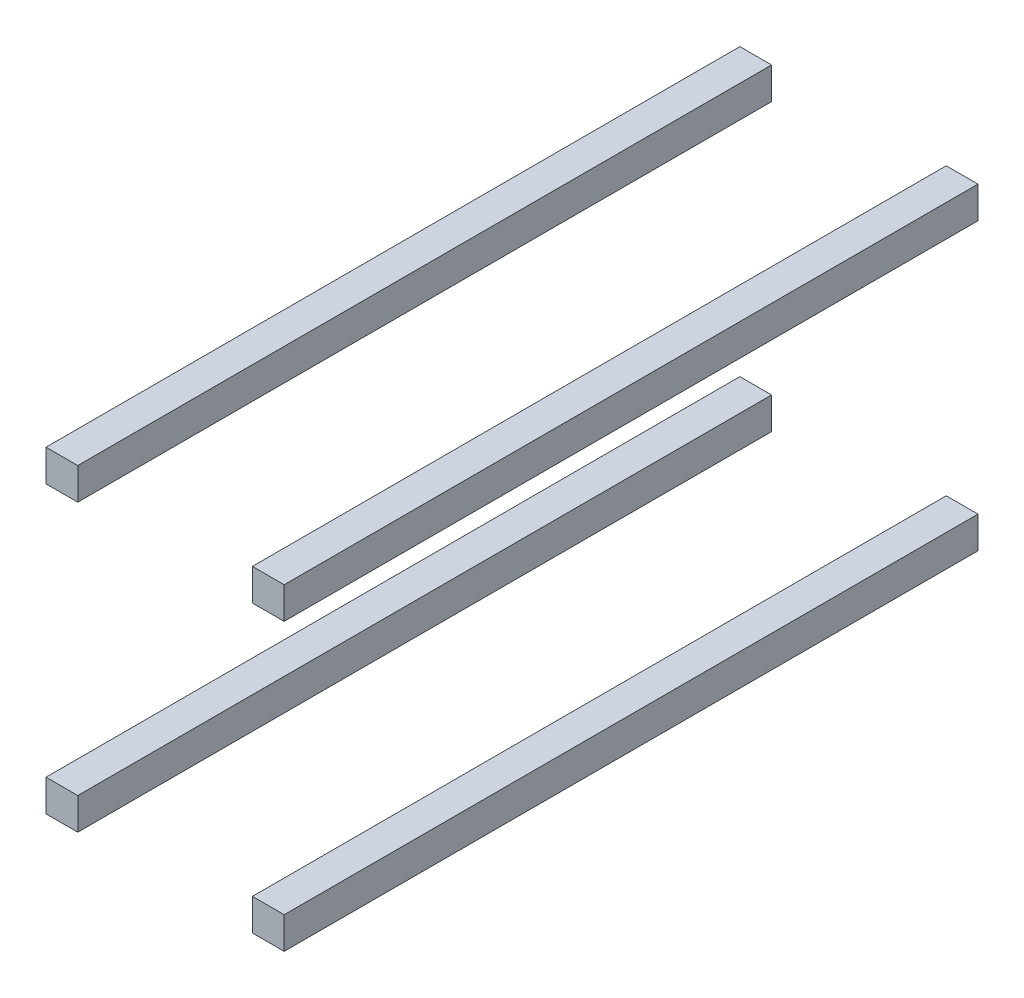
ISO-10303-21;
HEADER;
FILE_DESCRIPTION(('STEP AP214'),'2;1');
FILE_NAME('part.step','',(''),(''),'','','');
FILE_SCHEMA(('AUTOMOTIVE_DESIGN { 1 0 10303 214 1 1 1 1 }'));
ENDSEC;
DATA;
#1=APPLICATION_CONTEXT('core data for automotive mechanical design processes');
#2=APPLICATION_PROTOCOL_DEFINITION('international standard','automotive_design',2000,#1);
#3=PRODUCT_CONTEXT('',#1,'mechanical');
#4=PRODUCT('Part','Part','',(#3));
#5=PRODUCT_RELATED_PRODUCT_CATEGORY('part','',(#4));
#6=PRODUCT_DEFINITION_FORMATION('','',#4);
#7=PRODUCT_DEFINITION_CONTEXT('part definition',#1,'design');
#8=PRODUCT_DEFINITION('design','',#6,#7);
#9=PRODUCT_DEFINITION_SHAPE('','',#8);
#10=(LENGTH_UNIT() NAMED_UNIT(*) SI_UNIT(.MILLI.,.METRE.));
#11=(NAMED_UNIT(*) PLANE_ANGLE_UNIT() SI_UNIT($,.RADIAN.));
#12=(NAMED_UNIT(*) SI_UNIT($,.STERADIAN.) SOLID_ANGLE_UNIT());
#13=UNCERTAINTY_MEASURE_WITH_UNIT(LENGTH_MEASURE(1.E-05),#10,'distance_accuracy_value','');
#14=(GEOMETRIC_REPRESENTATION_CONTEXT(3) GLOBAL_UNCERTAINTY_ASSIGNED_CONTEXT((#13)) GLOBAL_UNIT_ASSIGNED_CONTEXT((#10,
#11,#12)) REPRESENTATION_CONTEXT('',''));
#15=CARTESIAN_POINT('',(0.,0.,0.));
#16=DIRECTION('',(0.,0.,1.));
#17=DIRECTION('',(1.,0.,0.));
#18=AXIS2_PLACEMENT_3D('',#15,#16,#17);
#19=CARTESIAN_POINT('',(0.,-160.,437.));
#20=DIRECTION('',(1.,0.,0.));
#21=DIRECTION('',(0.,1.,0.));
#22=AXIS2_PLACEMENT_3D('',#19,#20,#21);
#23=PLANE('',#22);
#24=DIRECTION('',(0.,-1.,0.));
#25=VECTOR('',#24,1.);
#26=CARTESIAN_POINT('',(0.,-160.,0.));
#27=LINE('',#26,#25);
#28=CARTESIAN_POINT('',(0.,-160.,0.));
#29=VERTEX_POINT('',#28);
#30=CARTESIAN_POINT('',(0.,-180.,0.));
#31=VERTEX_POINT('',#30);
#32=EDGE_CURVE('E12',#29,#31,#27,.T.);
#33=ORIENTED_EDGE('',*,*,#32,.T.);
#34=DIRECTION('',(0.,0.,-1.));
#35=VECTOR('',#34,1.);
#36=CARTESIAN_POINT('',(0.,-180.,437.));
#37=LINE('',#36,#35);
#38=CARTESIAN_POINT('',(0.,-180.,437.));
#39=VERTEX_POINT('',#38);
#40=EDGE_CURVE('E119',#39,#31,#37,.T.);
#41=ORIENTED_EDGE('',*,*,#40,.F.);
#42=DIRECTION('',(0.,-1.,0.));
#43=VECTOR('',#42,1.);
#44=CARTESIAN_POINT('',(0.,-160.,437.));
#45=LINE('',#44,#43);
#46=CARTESIAN_POINT('',(0.,-160.,437.));
#47=VERTEX_POINT('',#46);
#48=EDGE_CURVE('E52',#47,#39,#45,.T.);
#49=ORIENTED_EDGE('',*,*,#48,.F.);
#50=DIRECTION('',(0.,0.,-1.));
#51=VECTOR('',#50,1.);
#52=CARTESIAN_POINT('',(0.,-160.,437.));
#53=LINE('',#52,#51);
#54=EDGE_CURVE('E107',#47,#29,#53,.T.);
#55=ORIENTED_EDGE('',*,*,#54,.T.);
#56=EDGE_LOOP('',(#33,#41,#49,#55));
#57=FACE_BOUND('',#56,.T.);
#58=ADVANCED_FACE('F48',(#57),#23,.F.);
#59=CARTESIAN_POINT('',(0.,-180.,437.));
#60=DIRECTION('',(0.,1.,0.));
#61=DIRECTION('',(0.,0.,1.));
#62=AXIS2_PLACEMENT_3D('',#59,#60,#61);
#63=PLANE('',#62);
#64=DIRECTION('',(1.,0.,0.));
#65=VECTOR('',#64,1.);
#66=CARTESIAN_POINT('',(0.,-180.,0.));
#67=LINE('',#66,#65);
#68=CARTESIAN_POINT('',(20.,-180.,0.));
#69=VERTEX_POINT('',#68);
#70=EDGE_CURVE('E58',#31,#69,#67,.T.);
#71=ORIENTED_EDGE('',*,*,#70,.T.);
#72=DIRECTION('',(0.,0.,-1.));
#73=VECTOR('',#72,1.);
#74=CARTESIAN_POINT('',(20.,-180.,437.));
#75=LINE('',#74,#73);
#76=CARTESIAN_POINT('',(20.,-180.,437.));
#77=VERTEX_POINT('',#76);
#78=EDGE_CURVE('E103',#77,#69,#75,.T.);
#79=ORIENTED_EDGE('',*,*,#78,.F.);
#80=DIRECTION('',(1.,0.,0.));
#81=VECTOR('',#80,1.);
#82=CARTESIAN_POINT('',(0.,-180.,437.));
#83=LINE('',#82,#81);
#84=EDGE_CURVE('E82',#39,#77,#83,.T.);
#85=ORIENTED_EDGE('',*,*,#84,.F.);
#86=ORIENTED_EDGE('',*,*,#40,.T.);
#87=EDGE_LOOP('',(#71,#79,#85,#86));
#88=FACE_BOUND('',#87,.T.);
#89=ADVANCED_FACE('F122',(#88),#63,.F.);
#90=CARTESIAN_POINT('',(20.,-160.,437.));
#91=DIRECTION('',(-1.,0.,0.));
#92=DIRECTION('',(0.,-1.,0.));
#93=AXIS2_PLACEMENT_3D('',#90,#91,#92);
#94=PLANE('',#93);
#95=DIRECTION('',(0.,1.,0.));
#96=VECTOR('',#95,1.);
#97=CARTESIAN_POINT('',(20.,-160.,0.));
#98=LINE('',#97,#96);
#99=CARTESIAN_POINT('',(20.,-160.,0.));
#100=VERTEX_POINT('',#99);
#101=EDGE_CURVE('E98',#69,#100,#98,.T.);
#102=ORIENTED_EDGE('',*,*,#101,.T.);
#103=DIRECTION('',(0.,0.,-1.));
#104=VECTOR('',#103,1.);
#105=CARTESIAN_POINT('',(20.,-160.,437.));
#106=LINE('',#105,#104);
#107=CARTESIAN_POINT('',(20.,-160.,437.));
#108=VERTEX_POINT('',#107);
#109=EDGE_CURVE('E101',#108,#100,#106,.T.);
#110=ORIENTED_EDGE('',*,*,#109,.F.);
#111=DIRECTION('',(0.,1.,0.));
#112=VECTOR('',#111,1.);
#113=CARTESIAN_POINT('',(20.,-160.,437.));
#114=LINE('',#113,#112);
#115=EDGE_CURVE('E115',#77,#108,#114,.T.);
#116=ORIENTED_EDGE('',*,*,#115,.F.);
#117=ORIENTED_EDGE('',*,*,#78,.T.);
#118=EDGE_LOOP('',(#102,#110,#116,#117));
#119=FACE_BOUND('',#118,.T.);
#120=ADVANCED_FACE('F99',(#119),#94,.F.);
#121=CARTESIAN_POINT('',(0.,-160.,437.));
#122=DIRECTION('',(0.,-1.,0.));
#123=DIRECTION('',(0.,0.,-1.));
#124=AXIS2_PLACEMENT_3D('',#121,#122,#123);
#125=PLANE('',#124);
#126=DIRECTION('',(-1.,0.,0.));
#127=VECTOR('',#126,1.);
#128=CARTESIAN_POINT('',(0.,-160.,0.));
#129=LINE('',#128,#127);
#130=EDGE_CURVE('E92',#100,#29,#129,.T.);
#131=ORIENTED_EDGE('',*,*,#130,.T.);
#132=ORIENTED_EDGE('',*,*,#54,.F.);
#133=DIRECTION('',(-1.,0.,0.));
#134=VECTOR('',#133,1.);
#135=CARTESIAN_POINT('',(0.,-160.,437.));
#136=LINE('',#135,#134);
#137=EDGE_CURVE('E106',#108,#47,#136,.T.);
#138=ORIENTED_EDGE('',*,*,#137,.F.);
#139=ORIENTED_EDGE('',*,*,#109,.T.);
#140=EDGE_LOOP('',(#131,#132,#138,#139));
#141=FACE_BOUND('',#140,.T.);
#142=ADVANCED_FACE('F105',(#141),#125,.F.);
#143=CARTESIAN_POINT('',(0.,0.,437.));
#144=DIRECTION('',(0.,0.,1.));
#145=DIRECTION('',(1.,0.,0.));
#146=AXIS2_PLACEMENT_3D('',#143,#144,#145);
#147=PLANE('',#146);
#148=ORIENTED_EDGE('',*,*,#48,.T.);
#149=ORIENTED_EDGE('',*,*,#84,.T.);
#150=ORIENTED_EDGE('',*,*,#115,.T.);
#151=ORIENTED_EDGE('',*,*,#137,.T.);
#152=EDGE_LOOP('',(#148,#149,#150,#151));
#153=FACE_BOUND('',#152,.T.);
#154=ADVANCED_FACE('F50',(#153),#147,.T.);
#155=CARTESIAN_POINT('',(0.,0.,0.));
#156=DIRECTION('',(0.,0.,1.));
#157=DIRECTION('',(1.,0.,0.));
#158=AXIS2_PLACEMENT_3D('',#155,#156,#157);
#159=PLANE('',#158);
#160=ORIENTED_EDGE('',*,*,#32,.F.);
#161=ORIENTED_EDGE('',*,*,#130,.F.);
#162=ORIENTED_EDGE('',*,*,#101,.F.);
#163=ORIENTED_EDGE('',*,*,#70,.F.);
#164=EDGE_LOOP('',(#160,#161,#162,#163));
#165=FACE_BOUND('',#164,.T.);
#166=ADVANCED_FACE('F109',(#165),#159,.F.);
#167=CLOSED_SHELL('',(#58,#89,#120,#142,#154,#166));
#168=MANIFOLD_SOLID_BREP('B2',#167);
#169=CARTESIAN_POINT('',(150.,-160.,437.));
#170=DIRECTION('',(-1.,0.,0.));
#171=DIRECTION('',(0.,0.,1.));
#172=AXIS2_PLACEMENT_3D('',#169,#170,#171);
#173=PLANE('',#172);
#174=DIRECTION('',(0.,1.,0.));
#175=VECTOR('',#174,1.);
#176=CARTESIAN_POINT('',(150.,-160.,0.));
#177=LINE('',#176,#175);
#178=CARTESIAN_POINT('',(150.,-180.,0.));
#179=VERTEX_POINT('',#178);
#180=CARTESIAN_POINT('',(150.,-160.,0.));
#181=VERTEX_POINT('',#180);
#182=EDGE_CURVE('E46',#179,#181,#177,.T.);
#183=ORIENTED_EDGE('',*,*,#182,.T.);
#184=DIRECTION('',(0.,0.,-1.));
#185=VECTOR('',#184,1.);
#186=CARTESIAN_POINT('',(150.,-160.,437.));
#187=LINE('',#186,#185);
#188=CARTESIAN_POINT('',(150.,-160.,437.));
#189=VERTEX_POINT('',#188);
#190=EDGE_CURVE('E265',#189,#181,#187,.T.);
#191=ORIENTED_EDGE('',*,*,#190,.F.);
#192=DIRECTION('',(0.,1.,0.));
#193=VECTOR('',#192,1.);
#194=CARTESIAN_POINT('',(150.,-160.,437.));
#195=LINE('',#194,#193);
#196=CARTESIAN_POINT('',(150.,-180.,437.));
#197=VERTEX_POINT('',#196);
#198=EDGE_CURVE('E198',#197,#189,#195,.T.);
#199=ORIENTED_EDGE('',*,*,#198,.F.);
#200=DIRECTION('',(0.,0.,-1.));
#201=VECTOR('',#200,1.);
#202=CARTESIAN_POINT('',(150.,-180.,437.));
#203=LINE('',#202,#201);
#204=EDGE_CURVE('E253',#197,#179,#203,.T.);
#205=ORIENTED_EDGE('',*,*,#204,.T.);
#206=EDGE_LOOP('',(#183,#191,#199,#205));
#207=FACE_BOUND('',#206,.T.);
#208=ADVANCED_FACE('F194',(#207),#173,.F.);
#209=CARTESIAN_POINT('',(150.,-160.,437.));
#210=DIRECTION('',(0.,-1.,0.));
#211=DIRECTION('',(0.,0.,-1.));
#212=AXIS2_PLACEMENT_3D('',#209,#210,#211);
#213=PLANE('',#212);
#214=DIRECTION('',(-1.,0.,0.));
#215=VECTOR('',#214,1.);
#216=CARTESIAN_POINT('',(150.,-160.,0.));
#217=LINE('',#216,#215);
#218=CARTESIAN_POINT('',(130.,-160.,0.));
#219=VERTEX_POINT('',#218);
#220=EDGE_CURVE('E204',#181,#219,#217,.T.);
#221=ORIENTED_EDGE('',*,*,#220,.T.);
#222=DIRECTION('',(0.,0.,-1.));
#223=VECTOR('',#222,1.);
#224=CARTESIAN_POINT('',(130.,-160.,437.));
#225=LINE('',#224,#223);
#226=CARTESIAN_POINT('',(130.,-160.,437.));
#227=VERTEX_POINT('',#226);
#228=EDGE_CURVE('E249',#227,#219,#225,.T.);
#229=ORIENTED_EDGE('',*,*,#228,.F.);
#230=DIRECTION('',(-1.,0.,0.));
#231=VECTOR('',#230,1.);
#232=CARTESIAN_POINT('',(150.,-160.,437.));
#233=LINE('',#232,#231);
#234=EDGE_CURVE('E228',#189,#227,#233,.T.);
#235=ORIENTED_EDGE('',*,*,#234,.F.);
#236=ORIENTED_EDGE('',*,*,#190,.T.);
#237=EDGE_LOOP('',(#221,#229,#235,#236));
#238=FACE_BOUND('',#237,.T.);
#239=ADVANCED_FACE('F268',(#238),#213,.F.);
#240=CARTESIAN_POINT('',(130.,-160.,437.));
#241=DIRECTION('',(1.,0.,0.));
#242=DIRECTION('',(0.,0.,-1.));
#243=AXIS2_PLACEMENT_3D('',#240,#241,#242);
#244=PLANE('',#243);
#245=DIRECTION('',(0.,-1.,0.));
#246=VECTOR('',#245,1.);
#247=CARTESIAN_POINT('',(130.,-160.,0.));
#248=LINE('',#247,#246);
#249=CARTESIAN_POINT('',(130.,-180.,0.));
#250=VERTEX_POINT('',#249);
#251=EDGE_CURVE('E244',#219,#250,#248,.T.);
#252=ORIENTED_EDGE('',*,*,#251,.T.);
#253=DIRECTION('',(0.,0.,-1.));
#254=VECTOR('',#253,1.);
#255=CARTESIAN_POINT('',(130.,-180.,437.));
#256=LINE('',#255,#254);
#257=CARTESIAN_POINT('',(130.,-180.,437.));
#258=VERTEX_POINT('',#257);
#259=EDGE_CURVE('E247',#258,#250,#256,.T.);
#260=ORIENTED_EDGE('',*,*,#259,.F.);
#261=DIRECTION('',(0.,-1.,0.));
#262=VECTOR('',#261,1.);
#263=CARTESIAN_POINT('',(130.,-160.,437.));
#264=LINE('',#263,#262);
#265=EDGE_CURVE('E261',#227,#258,#264,.T.);
#266=ORIENTED_EDGE('',*,*,#265,.F.);
#267=ORIENTED_EDGE('',*,*,#228,.T.);
#268=EDGE_LOOP('',(#252,#260,#266,#267));
#269=FACE_BOUND('',#268,.T.);
#270=ADVANCED_FACE('F245',(#269),#244,.F.);
#271=CARTESIAN_POINT('',(150.,-180.,437.));
#272=DIRECTION('',(0.,1.,0.));
#273=DIRECTION('',(0.,0.,1.));
#274=AXIS2_PLACEMENT_3D('',#271,#272,#273);
#275=PLANE('',#274);
#276=DIRECTION('',(1.,0.,0.));
#277=VECTOR('',#276,1.);
#278=CARTESIAN_POINT('',(150.,-180.,0.));
#279=LINE('',#278,#277);
#280=EDGE_CURVE('E238',#250,#179,#279,.T.);
#281=ORIENTED_EDGE('',*,*,#280,.T.);
#282=ORIENTED_EDGE('',*,*,#204,.F.);
#283=DIRECTION('',(1.,0.,0.));
#284=VECTOR('',#283,1.);
#285=CARTESIAN_POINT('',(150.,-180.,437.));
#286=LINE('',#285,#284);
#287=EDGE_CURVE('E252',#258,#197,#286,.T.);
#288=ORIENTED_EDGE('',*,*,#287,.F.);
#289=ORIENTED_EDGE('',*,*,#259,.T.);
#290=EDGE_LOOP('',(#281,#282,#288,#289));
#291=FACE_BOUND('',#290,.T.);
#292=ADVANCED_FACE('F251',(#291),#275,.F.);
#293=CARTESIAN_POINT('',(0.,0.,437.));
#294=DIRECTION('',(0.,0.,-1.));
#295=DIRECTION('',(-1.,0.,0.));
#296=AXIS2_PLACEMENT_3D('',#293,#294,#295);
#297=PLANE('',#296);
#298=ORIENTED_EDGE('',*,*,#198,.T.);
#299=ORIENTED_EDGE('',*,*,#234,.T.);
#300=ORIENTED_EDGE('',*,*,#265,.T.);
#301=ORIENTED_EDGE('',*,*,#287,.T.);
#302=EDGE_LOOP('',(#298,#299,#300,#301));
#303=FACE_BOUND('',#302,.T.);
#304=ADVANCED_FACE('F196',(#303),#297,.F.);
#305=CARTESIAN_POINT('',(0.,0.,0.));
#306=DIRECTION('',(0.,0.,-1.));
#307=DIRECTION('',(-1.,0.,0.));
#308=AXIS2_PLACEMENT_3D('',#305,#306,#307);
#309=PLANE('',#308);
#310=ORIENTED_EDGE('',*,*,#182,.F.);
#311=ORIENTED_EDGE('',*,*,#280,.F.);
#312=ORIENTED_EDGE('',*,*,#251,.F.);
#313=ORIENTED_EDGE('',*,*,#220,.F.);
#314=EDGE_LOOP('',(#310,#311,#312,#313));
#315=FACE_BOUND('',#314,.T.);
#316=ADVANCED_FACE('F255',(#315),#309,.T.);
#317=CLOSED_SHELL('',(#208,#239,#270,#292,#304,#316));
#318=MANIFOLD_SOLID_BREP('B6',#317);
#319=CARTESIAN_POINT('',(130.,0.,437.));
#320=DIRECTION('',(1.,0.,0.));
#321=DIRECTION('',(0.,0.,-1.));
#322=AXIS2_PLACEMENT_3D('',#319,#320,#321);
#323=PLANE('',#322);
#324=DIRECTION('',(0.,-1.,0.));
#325=VECTOR('',#324,1.);
#326=CARTESIAN_POINT('',(130.,0.,0.));
#327=LINE('',#326,#325);
#328=CARTESIAN_POINT('',(130.,20.,0.));
#329=VERTEX_POINT('',#328);
#330=CARTESIAN_POINT('',(130.,0.,0.));
#331=VERTEX_POINT('',#330);
#332=EDGE_CURVE('E192',#329,#331,#327,.T.);
#333=ORIENTED_EDGE('',*,*,#332,.T.);
#334=DIRECTION('',(0.,0.,-1.));
#335=VECTOR('',#334,1.);
#336=CARTESIAN_POINT('',(130.,0.,437.));
#337=LINE('',#336,#335);
#338=CARTESIAN_POINT('',(130.,0.,437.));
#339=VERTEX_POINT('',#338);
#340=EDGE_CURVE('E410',#339,#331,#337,.T.);
#341=ORIENTED_EDGE('',*,*,#340,.F.);
#342=DIRECTION('',(0.,-1.,0.));
#343=VECTOR('',#342,1.);
#344=CARTESIAN_POINT('',(130.,0.,437.));
#345=LINE('',#344,#343);
#346=CARTESIAN_POINT('',(130.,20.,437.));
#347=VERTEX_POINT('',#346);
#348=EDGE_CURVE('E343',#347,#339,#345,.T.);
#349=ORIENTED_EDGE('',*,*,#348,.F.);
#350=DIRECTION('',(0.,0.,-1.));
#351=VECTOR('',#350,1.);
#352=CARTESIAN_POINT('',(130.,20.,437.));
#353=LINE('',#352,#351);
#354=EDGE_CURVE('E398',#347,#329,#353,.T.);
#355=ORIENTED_EDGE('',*,*,#354,.T.);
#356=EDGE_LOOP('',(#333,#341,#349,#355));
#357=FACE_BOUND('',#356,.T.);
#358=ADVANCED_FACE('F339',(#357),#323,.F.);
#359=CARTESIAN_POINT('',(130.,0.,437.));
#360=DIRECTION('',(0.,1.,0.));
#361=DIRECTION('',(0.,0.,1.));
#362=AXIS2_PLACEMENT_3D('',#359,#360,#361);
#363=PLANE('',#362);
#364=DIRECTION('',(1.,0.,0.));
#365=VECTOR('',#364,1.);
#366=CARTESIAN_POINT('',(130.,0.,0.));
#367=LINE('',#366,#365);
#368=CARTESIAN_POINT('',(150.,0.,0.));
#369=VERTEX_POINT('',#368);
#370=EDGE_CURVE('E349',#331,#369,#367,.T.);
#371=ORIENTED_EDGE('',*,*,#370,.T.);
#372=DIRECTION('',(0.,0.,-1.));
#373=VECTOR('',#372,1.);
#374=CARTESIAN_POINT('',(150.,0.,437.));
#375=LINE('',#374,#373);
#376=CARTESIAN_POINT('',(150.,0.,437.));
#377=VERTEX_POINT('',#376);
#378=EDGE_CURVE('E394',#377,#369,#375,.T.);
#379=ORIENTED_EDGE('',*,*,#378,.F.);
#380=DIRECTION('',(1.,0.,0.));
#381=VECTOR('',#380,1.);
#382=CARTESIAN_POINT('',(130.,0.,437.));
#383=LINE('',#382,#381);
#384=EDGE_CURVE('E373',#339,#377,#383,.T.);
#385=ORIENTED_EDGE('',*,*,#384,.F.);
#386=ORIENTED_EDGE('',*,*,#340,.T.);
#387=EDGE_LOOP('',(#371,#379,#385,#386));
#388=FACE_BOUND('',#387,.T.);
#389=ADVANCED_FACE('F413',(#388),#363,.F.);
#390=CARTESIAN_POINT('',(150.,0.,437.));
#391=DIRECTION('',(-1.,0.,0.));
#392=DIRECTION('',(0.,0.,1.));
#393=AXIS2_PLACEMENT_3D('',#390,#391,#392);
#394=PLANE('',#393);
#395=DIRECTION('',(0.,1.,0.));
#396=VECTOR('',#395,1.);
#397=CARTESIAN_POINT('',(150.,0.,0.));
#398=LINE('',#397,#396);
#399=CARTESIAN_POINT('',(150.,20.,0.));
#400=VERTEX_POINT('',#399);
#401=EDGE_CURVE('E389',#369,#400,#398,.T.);
#402=ORIENTED_EDGE('',*,*,#401,.T.);
#403=DIRECTION('',(0.,0.,-1.));
#404=VECTOR('',#403,1.);
#405=CARTESIAN_POINT('',(150.,20.,437.));
#406=LINE('',#405,#404);
#407=CARTESIAN_POINT('',(150.,20.,437.));
#408=VERTEX_POINT('',#407);
#409=EDGE_CURVE('E392',#408,#400,#406,.T.);
#410=ORIENTED_EDGE('',*,*,#409,.F.);
#411=DIRECTION('',(0.,1.,0.));
#412=VECTOR('',#411,1.);
#413=CARTESIAN_POINT('',(150.,0.,437.));
#414=LINE('',#413,#412);
#415=EDGE_CURVE('E406',#377,#408,#414,.T.);
#416=ORIENTED_EDGE('',*,*,#415,.F.);
#417=ORIENTED_EDGE('',*,*,#378,.T.);
#418=EDGE_LOOP('',(#402,#410,#416,#417));
#419=FACE_BOUND('',#418,.T.);
#420=ADVANCED_FACE('F390',(#419),#394,.F.);
#421=CARTESIAN_POINT('',(130.,20.,437.));
#422=DIRECTION('',(0.,-1.,0.));
#423=DIRECTION('',(0.,0.,-1.));
#424=AXIS2_PLACEMENT_3D('',#421,#422,#423);
#425=PLANE('',#424);
#426=DIRECTION('',(-1.,0.,0.));
#427=VECTOR('',#426,1.);
#428=CARTESIAN_POINT('',(130.,20.,0.));
#429=LINE('',#428,#427);
#430=EDGE_CURVE('E383',#400,#329,#429,.T.);
#431=ORIENTED_EDGE('',*,*,#430,.T.);
#432=ORIENTED_EDGE('',*,*,#354,.F.);
#433=DIRECTION('',(-1.,0.,0.));
#434=VECTOR('',#433,1.);
#435=CARTESIAN_POINT('',(130.,20.,437.));
#436=LINE('',#435,#434);
#437=EDGE_CURVE('E397',#408,#347,#436,.T.);
#438=ORIENTED_EDGE('',*,*,#437,.F.);
#439=ORIENTED_EDGE('',*,*,#409,.T.);
#440=EDGE_LOOP('',(#431,#432,#438,#439));
#441=FACE_BOUND('',#440,.T.);
#442=ADVANCED_FACE('F396',(#441),#425,.F.);
#443=CARTESIAN_POINT('',(0.,0.,437.));
#444=DIRECTION('',(0.,0.,-1.));
#445=DIRECTION('',(-1.,0.,0.));
#446=AXIS2_PLACEMENT_3D('',#443,#444,#445);
#447=PLANE('',#446);
#448=ORIENTED_EDGE('',*,*,#348,.T.);
#449=ORIENTED_EDGE('',*,*,#384,.T.);
#450=ORIENTED_EDGE('',*,*,#415,.T.);
#451=ORIENTED_EDGE('',*,*,#437,.T.);
#452=EDGE_LOOP('',(#448,#449,#450,#451));
#453=FACE_BOUND('',#452,.T.);
#454=ADVANCED_FACE('F341',(#453),#447,.F.);
#455=CARTESIAN_POINT('',(0.,0.,0.));
#456=DIRECTION('',(0.,0.,-1.));
#457=DIRECTION('',(-1.,0.,0.));
#458=AXIS2_PLACEMENT_3D('',#455,#456,#457);
#459=PLANE('',#458);
#460=ORIENTED_EDGE('',*,*,#332,.F.);
#461=ORIENTED_EDGE('',*,*,#430,.F.);
#462=ORIENTED_EDGE('',*,*,#401,.F.);
#463=ORIENTED_EDGE('',*,*,#370,.F.);
#464=EDGE_LOOP('',(#460,#461,#462,#463));
#465=FACE_BOUND('',#464,.T.);
#466=ADVANCED_FACE('F400',(#465),#459,.T.);
#467=CLOSED_SHELL('',(#358,#389,#420,#442,#454,#466));
#468=MANIFOLD_SOLID_BREP('B40',#467);
#469=CARTESIAN_POINT('',(0.,0.,437.));
#470=DIRECTION('',(1.,0.,0.));
#471=DIRECTION('',(0.,0.,-1.));
#472=AXIS2_PLACEMENT_3D('',#469,#470,#471);
#473=PLANE('',#472);
#474=DIRECTION('',(0.,-1.,0.));
#475=VECTOR('',#474,1.);
#476=CARTESIAN_POINT('',(0.,0.,0.));
#477=LINE('',#476,#475);
#478=CARTESIAN_POINT('',(0.,20.,0.));
#479=VERTEX_POINT('',#478);
#480=CARTESIAN_POINT('',(0.,0.,0.));
#481=VERTEX_POINT('',#480);
#482=EDGE_CURVE('E538',#479,#481,#477,.T.);
#483=ORIENTED_EDGE('',*,*,#482,.T.);
#484=DIRECTION('',(0.,0.,-1.));
#485=VECTOR('',#484,1.);
#486=CARTESIAN_POINT('',(0.,0.,437.));
#487=LINE('',#486,#485);
#488=CARTESIAN_POINT('',(0.,0.,437.));
#489=VERTEX_POINT('',#488);
#490=EDGE_CURVE('E337',#489,#481,#487,.T.);
#491=ORIENTED_EDGE('',*,*,#490,.F.);
#492=DIRECTION('',(0.,-1.,0.));
#493=VECTOR('',#492,1.);
#494=CARTESIAN_POINT('',(0.,0.,437.));
#495=LINE('',#494,#493);
#496=CARTESIAN_POINT('',(0.,20.,437.));
#497=VERTEX_POINT('',#496);
#498=EDGE_CURVE('E526',#497,#489,#495,.T.);
#499=ORIENTED_EDGE('',*,*,#498,.F.);
#500=DIRECTION('',(0.,0.,-1.));
#501=VECTOR('',#500,1.);
#502=CARTESIAN_POINT('',(0.,20.,437.));
#503=LINE('',#502,#501);
#504=EDGE_CURVE('E534',#497,#479,#503,.T.);
#505=ORIENTED_EDGE('',*,*,#504,.T.);
#506=EDGE_LOOP('',(#483,#491,#499,#505));
#507=FACE_BOUND('',#506,.T.);
#508=ADVANCED_FACE('F475',(#507),#473,.F.);
#509=CARTESIAN_POINT('',(0.,0.,437.));
#510=DIRECTION('',(0.,1.,0.));
#511=DIRECTION('',(0.,0.,1.));
#512=AXIS2_PLACEMENT_3D('',#509,#510,#511);
#513=PLANE('',#512);
#514=DIRECTION('',(1.,0.,0.));
#515=VECTOR('',#514,1.);
#516=CARTESIAN_POINT('',(0.,0.,0.));
#517=LINE('',#516,#515);
#518=CARTESIAN_POINT('',(20.,0.,0.));
#519=VERTEX_POINT('',#518);
#520=EDGE_CURVE('E530',#481,#519,#517,.T.);
#521=ORIENTED_EDGE('',*,*,#520,.T.);
#522=DIRECTION('',(0.,0.,-1.));
#523=VECTOR('',#522,1.);
#524=CARTESIAN_POINT('',(20.,0.,437.));
#525=LINE('',#524,#523);
#526=CARTESIAN_POINT('',(20.,0.,437.));
#527=VERTEX_POINT('',#526);
#528=EDGE_CURVE('E483',#527,#519,#525,.T.);
#529=ORIENTED_EDGE('',*,*,#528,.F.);
#530=DIRECTION('',(1.,0.,0.));
#531=VECTOR('',#530,1.);
#532=CARTESIAN_POINT('',(0.,0.,437.));
#533=LINE('',#532,#531);
#534=EDGE_CURVE('E521',#489,#527,#533,.T.);
#535=ORIENTED_EDGE('',*,*,#534,.F.);
#536=ORIENTED_EDGE('',*,*,#490,.T.);
#537=EDGE_LOOP('',(#521,#529,#535,#536));
#538=FACE_BOUND('',#537,.T.);
#539=ADVANCED_FACE('F529',(#538),#513,.F.);
#540=CARTESIAN_POINT('',(20.,0.,437.));
#541=DIRECTION('',(-1.,0.,0.));
#542=DIRECTION('',(0.,0.,1.));
#543=AXIS2_PLACEMENT_3D('',#540,#541,#542);
#544=PLANE('',#543);
#545=DIRECTION('',(0.,1.,0.));
#546=VECTOR('',#545,1.);
#547=CARTESIAN_POINT('',(20.,0.,0.));
#548=LINE('',#547,#546);
#549=CARTESIAN_POINT('',(20.,20.,0.));
#550=VERTEX_POINT('',#549);
#551=EDGE_CURVE('E508',#519,#550,#548,.T.);
#552=ORIENTED_EDGE('',*,*,#551,.T.);
#553=DIRECTION('',(0.,0.,-1.));
#554=VECTOR('',#553,1.);
#555=CARTESIAN_POINT('',(20.,20.,437.));
#556=LINE('',#555,#554);
#557=CARTESIAN_POINT('',(20.,20.,437.));
#558=VERTEX_POINT('',#557);
#559=EDGE_CURVE('E531',#558,#550,#556,.T.);
#560=ORIENTED_EDGE('',*,*,#559,.F.);
#561=DIRECTION('',(0.,1.,0.));
#562=VECTOR('',#561,1.);
#563=CARTESIAN_POINT('',(20.,0.,437.));
#564=LINE('',#563,#562);
#565=EDGE_CURVE('E524',#527,#558,#564,.T.);
#566=ORIENTED_EDGE('',*,*,#565,.F.);
#567=ORIENTED_EDGE('',*,*,#528,.T.);
#568=EDGE_LOOP('',(#552,#560,#566,#567));
#569=FACE_BOUND('',#568,.T.);
#570=ADVANCED_FACE('F532',(#569),#544,.F.);
#571=CARTESIAN_POINT('',(0.,20.,437.));
#572=DIRECTION('',(0.,-1.,0.));
#573=DIRECTION('',(0.,0.,-1.));
#574=AXIS2_PLACEMENT_3D('',#571,#572,#573);
#575=PLANE('',#574);
#576=DIRECTION('',(-1.,0.,0.));
#577=VECTOR('',#576,1.);
#578=CARTESIAN_POINT('',(0.,20.,0.));
#579=LINE('',#578,#577);
#580=EDGE_CURVE('E514',#550,#479,#579,.T.);
#581=ORIENTED_EDGE('',*,*,#580,.T.);
#582=ORIENTED_EDGE('',*,*,#504,.F.);
#583=DIRECTION('',(-1.,0.,0.));
#584=VECTOR('',#583,1.);
#585=CARTESIAN_POINT('',(0.,20.,437.));
#586=LINE('',#585,#584);
#587=EDGE_CURVE('E491',#558,#497,#586,.T.);
#588=ORIENTED_EDGE('',*,*,#587,.F.);
#589=ORIENTED_EDGE('',*,*,#559,.T.);
#590=EDGE_LOOP('',(#581,#582,#588,#589));
#591=FACE_BOUND('',#590,.T.);
#592=ADVANCED_FACE('F545',(#591),#575,.F.);
#593=CARTESIAN_POINT('',(0.,0.,437.));
#594=DIRECTION('',(0.,0.,-1.));
#595=DIRECTION('',(-1.,0.,0.));
#596=AXIS2_PLACEMENT_3D('',#593,#594,#595);
#597=PLANE('',#596);
#598=ORIENTED_EDGE('',*,*,#498,.T.);
#599=ORIENTED_EDGE('',*,*,#534,.T.);
#600=ORIENTED_EDGE('',*,*,#565,.T.);
#601=ORIENTED_EDGE('',*,*,#587,.T.);
#602=EDGE_LOOP('',(#598,#599,#600,#601));
#603=FACE_BOUND('',#602,.T.);
#604=ADVANCED_FACE('F522',(#603),#597,.F.);
#605=CARTESIAN_POINT('',(0.,0.,0.));
#606=DIRECTION('',(0.,0.,-1.));
#607=DIRECTION('',(-1.,0.,0.));
#608=AXIS2_PLACEMENT_3D('',#605,#606,#607);
#609=PLANE('',#608);
#610=ORIENTED_EDGE('',*,*,#482,.F.);
#611=ORIENTED_EDGE('',*,*,#580,.F.);
#612=ORIENTED_EDGE('',*,*,#551,.F.);
#613=ORIENTED_EDGE('',*,*,#520,.F.);
#614=EDGE_LOOP('',(#610,#611,#612,#613));
#615=FACE_BOUND('',#614,.T.);
#616=ADVANCED_FACE('F548',(#615),#609,.T.);
#617=CLOSED_SHELL('',(#508,#539,#570,#592,#604,#616));
#618=MANIFOLD_SOLID_BREP('B186',#617);
#619=ADVANCED_BREP_SHAPE_REPRESENTATION('',(#18,#168,#318,#468,#618),#14);
#620=SHAPE_DEFINITION_REPRESENTATION(#9,#619);
ENDSEC;
END-ISO-10303-21;
